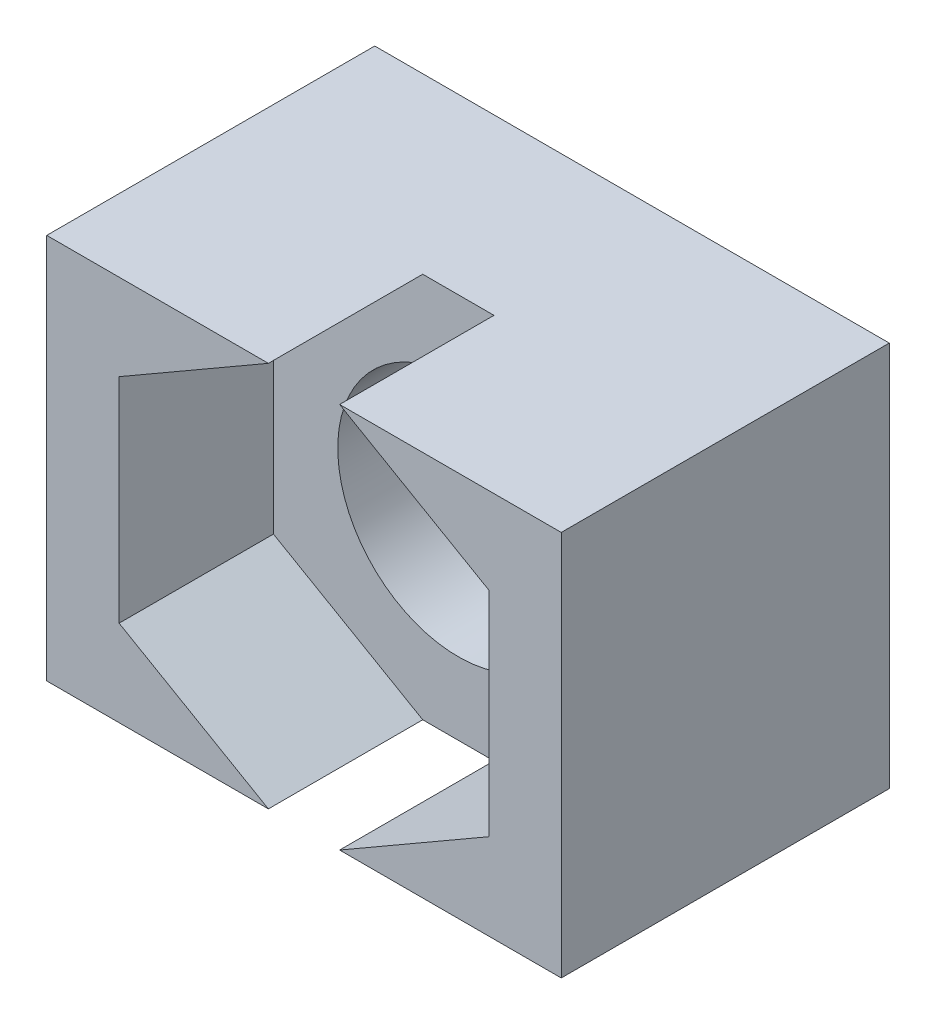
ISO-10303-21;
HEADER;
FILE_DESCRIPTION(('STEP AP214'),'2;1');
FILE_NAME('part.step','',(''),(''),'','','');
FILE_SCHEMA(('AUTOMOTIVE_DESIGN { 1 0 10303 214 1 1 1 1 }'));
ENDSEC;
DATA;
#1=APPLICATION_CONTEXT('core data for automotive mechanical design processes');
#2=APPLICATION_PROTOCOL_DEFINITION('international standard','automotive_design',2000,#1);
#3=PRODUCT_CONTEXT('',#1,'mechanical');
#4=PRODUCT('Part','Part','',(#3));
#5=PRODUCT_RELATED_PRODUCT_CATEGORY('part','',(#4));
#6=PRODUCT_DEFINITION_FORMATION('','',#4);
#7=PRODUCT_DEFINITION_CONTEXT('part definition',#1,'design');
#8=PRODUCT_DEFINITION('design','',#6,#7);
#9=PRODUCT_DEFINITION_SHAPE('','',#8);
#10=(LENGTH_UNIT() NAMED_UNIT(*) SI_UNIT(.MILLI.,.METRE.));
#11=(NAMED_UNIT(*) PLANE_ANGLE_UNIT() SI_UNIT($,.RADIAN.));
#12=(NAMED_UNIT(*) SI_UNIT($,.STERADIAN.) SOLID_ANGLE_UNIT());
#13=UNCERTAINTY_MEASURE_WITH_UNIT(LENGTH_MEASURE(1.E-05),#10,'distance_accuracy_value','');
#14=(GEOMETRIC_REPRESENTATION_CONTEXT(3) GLOBAL_UNCERTAINTY_ASSIGNED_CONTEXT((#13)) GLOBAL_UNIT_ASSIGNED_CONTEXT((#10,
#11,#12)) REPRESENTATION_CONTEXT('',''));
#15=CARTESIAN_POINT('',(0.,0.,0.));
#16=DIRECTION('',(0.,0.,1.));
#17=DIRECTION('',(1.,0.,0.));
#18=AXIS2_PLACEMENT_3D('',#15,#16,#17);
#19=CARTESIAN_POINT('',(0.,0.,5.1));
#20=DIRECTION('',(0.,0.,1.));
#21=DIRECTION('',(1.,0.,0.));
#22=AXIS2_PLACEMENT_3D('',#19,#20,#21);
#23=PLANE('',#22);
#24=DIRECTION('',(0.866025403784438,-0.5,0.));
#25=VECTOR('',#24,1.);
#26=CARTESIAN_POINT('',(-2.875,-1.65988202392017,5.1));
#27=LINE('',#26,#25);
#28=CARTESIAN_POINT('',(-2.875,-1.65988202392017,5.1));
#29=VERTEX_POINT('',#28);
#30=CARTESIAN_POINT('',(-0.553847577293371,-3.,5.1));
#31=VERTEX_POINT('',#30);
#32=EDGE_CURVE('E162',#29,#31,#27,.T.);
#33=ORIENTED_EDGE('',*,*,#32,.F.);
#34=DIRECTION('',(0.,-1.,0.));
#35=VECTOR('',#34,1.);
#36=CARTESIAN_POINT('',(-2.875,1.65988202392017,5.1));
#37=LINE('',#36,#35);
#38=CARTESIAN_POINT('',(-2.875,1.65988202392017,5.1));
#39=VERTEX_POINT('',#38);
#40=EDGE_CURVE('E169',#39,#29,#37,.T.);
#41=ORIENTED_EDGE('',*,*,#40,.F.);
#42=DIRECTION('',(-0.866025403784439,-0.5,0.));
#43=VECTOR('',#42,1.);
#44=CARTESIAN_POINT('',(-1.4375,2.48982303588026,5.1));
#45=LINE('',#44,#43);
#46=CARTESIAN_POINT('',(-0.553847577293371,3.,5.1));
#47=VERTEX_POINT('',#46);
#48=EDGE_CURVE('E40',#47,#39,#45,.T.);
#49=ORIENTED_EDGE('',*,*,#48,.F.);
#50=DIRECTION('',(-1.,0.,0.));
#51=VECTOR('',#50,1.);
#52=CARTESIAN_POINT('',(-4.,3.,5.1));
#53=LINE('',#52,#51);
#54=CARTESIAN_POINT('',(-4.,3.,5.1));
#55=VERTEX_POINT('',#54);
#56=EDGE_CURVE('E192',#47,#55,#53,.T.);
#57=ORIENTED_EDGE('',*,*,#56,.T.);
#58=DIRECTION('',(0.,-1.,0.));
#59=VECTOR('',#58,1.);
#60=CARTESIAN_POINT('',(-4.,3.,5.1));
#61=LINE('',#60,#59);
#62=CARTESIAN_POINT('',(-4.,-3.,5.1));
#63=VERTEX_POINT('',#62);
#64=EDGE_CURVE('E194',#55,#63,#61,.T.);
#65=ORIENTED_EDGE('',*,*,#64,.T.);
#66=DIRECTION('',(1.,0.,0.));
#67=VECTOR('',#66,1.);
#68=CARTESIAN_POINT('',(-4.,-3.,5.1));
#69=LINE('',#68,#67);
#70=EDGE_CURVE('E196',#63,#31,#69,.T.);
#71=ORIENTED_EDGE('',*,*,#70,.T.);
#72=EDGE_LOOP('',(#33,#41,#49,#57,#65,#71));
#73=FACE_BOUND('',#72,.T.);
#74=ADVANCED_FACE('F32',(#73),#23,.T.);
#75=CARTESIAN_POINT('',(4.,3.,5.1));
#76=DIRECTION('',(-1.,0.,0.));
#77=DIRECTION('',(0.,0.,1.));
#78=AXIS2_PLACEMENT_3D('',#75,#76,#77);
#79=PLANE('',#78);
#80=DIRECTION('',(0.,1.,0.));
#81=VECTOR('',#80,1.);
#82=CARTESIAN_POINT('',(4.,3.,0.));
#83=LINE('',#82,#81);
#84=CARTESIAN_POINT('',(4.,-3.,0.));
#85=VERTEX_POINT('',#84);
#86=CARTESIAN_POINT('',(4.,3.,0.));
#87=VERTEX_POINT('',#86);
#88=EDGE_CURVE('E189',#85,#87,#83,.T.);
#89=ORIENTED_EDGE('',*,*,#88,.T.);
#90=DIRECTION('',(0.,0.,-1.));
#91=VECTOR('',#90,1.);
#92=CARTESIAN_POINT('',(4.,3.,5.1));
#93=LINE('',#92,#91);
#94=CARTESIAN_POINT('',(4.,3.,5.1));
#95=VERTEX_POINT('',#94);
#96=EDGE_CURVE('E213',#95,#87,#93,.T.);
#97=ORIENTED_EDGE('',*,*,#96,.F.);
#98=DIRECTION('',(0.,1.,0.));
#99=VECTOR('',#98,1.);
#100=CARTESIAN_POINT('',(4.,3.,5.1));
#101=LINE('',#100,#99);
#102=CARTESIAN_POINT('',(4.,-3.,5.1));
#103=VERTEX_POINT('',#102);
#104=EDGE_CURVE('E190',#103,#95,#101,.T.);
#105=ORIENTED_EDGE('',*,*,#104,.F.);
#106=DIRECTION('',(0.,0.,-1.));
#107=VECTOR('',#106,1.);
#108=CARTESIAN_POINT('',(4.,-3.,5.1));
#109=LINE('',#108,#107);
#110=EDGE_CURVE('E199',#103,#85,#109,.T.);
#111=ORIENTED_EDGE('',*,*,#110,.T.);
#112=EDGE_LOOP('',(#89,#97,#105,#111));
#113=FACE_BOUND('',#112,.T.);
#114=ADVANCED_FACE('F34',(#113),#79,.F.);
#115=CARTESIAN_POINT('',(-4.,3.,5.1));
#116=DIRECTION('',(0.,-1.,0.));
#117=DIRECTION('',(0.,0.,-1.));
#118=AXIS2_PLACEMENT_3D('',#115,#116,#117);
#119=PLANE('',#118);
#120=ORIENTED_EDGE('',*,*,#56,.F.);
#121=DIRECTION('',(0.,0.,-1.));
#122=VECTOR('',#121,1.);
#123=CARTESIAN_POINT('',(-0.553847577293371,3.,5.1));
#124=LINE('',#123,#122);
#125=CARTESIAN_POINT('',(-0.55384757729337,3.,2.7));
#126=VERTEX_POINT('',#125);
#127=EDGE_CURVE('E181',#47,#126,#124,.T.);
#128=ORIENTED_EDGE('',*,*,#127,.T.);
#129=DIRECTION('',(-1.,0.,0.));
#130=VECTOR('',#129,1.);
#131=CARTESIAN_POINT('',(-4.,3.,2.7));
#132=LINE('',#131,#130);
#133=CARTESIAN_POINT('',(0.553847577293372,3.,2.7));
#134=VERTEX_POINT('',#133);
#135=EDGE_CURVE('E187',#134,#126,#132,.T.);
#136=ORIENTED_EDGE('',*,*,#135,.F.);
#137=DIRECTION('',(0.,0.,1.));
#138=VECTOR('',#137,1.);
#139=CARTESIAN_POINT('',(0.553847577293373,3.,5.1));
#140=LINE('',#139,#138);
#141=CARTESIAN_POINT('',(0.553847577293372,3.,5.1));
#142=VERTEX_POINT('',#141);
#143=EDGE_CURVE('E179',#134,#142,#140,.T.);
#144=ORIENTED_EDGE('',*,*,#143,.T.);
#145=EDGE_CURVE('E85',#95,#142,#53,.T.);
#146=ORIENTED_EDGE('',*,*,#145,.F.);
#147=ORIENTED_EDGE('',*,*,#96,.T.);
#148=DIRECTION('',(-1.,0.,0.));
#149=VECTOR('',#148,1.);
#150=CARTESIAN_POINT('',(-4.,3.,0.));
#151=LINE('',#150,#149);
#152=CARTESIAN_POINT('',(-4.,3.,0.));
#153=VERTEX_POINT('',#152);
#154=EDGE_CURVE('E202',#87,#153,#151,.T.);
#155=ORIENTED_EDGE('',*,*,#154,.T.);
#156=DIRECTION('',(0.,0.,-1.));
#157=VECTOR('',#156,1.);
#158=CARTESIAN_POINT('',(-4.,3.,5.1));
#159=LINE('',#158,#157);
#160=EDGE_CURVE('E210',#55,#153,#159,.T.);
#161=ORIENTED_EDGE('',*,*,#160,.F.);
#162=EDGE_LOOP('',(#120,#128,#136,#144,#146,#147,#155,#161));
#163=FACE_BOUND('',#162,.T.);
#164=ADVANCED_FACE('F241',(#163),#119,.F.);
#165=CARTESIAN_POINT('',(-4.,3.,5.1));
#166=DIRECTION('',(1.,0.,0.));
#167=DIRECTION('',(0.,1.,0.));
#168=AXIS2_PLACEMENT_3D('',#165,#166,#167);
#169=PLANE('',#168);
#170=DIRECTION('',(0.,-1.,0.));
#171=VECTOR('',#170,1.);
#172=CARTESIAN_POINT('',(-4.,3.,0.));
#173=LINE('',#172,#171);
#174=CARTESIAN_POINT('',(-4.,-3.,0.));
#175=VERTEX_POINT('',#174);
#176=EDGE_CURVE('E204',#153,#175,#173,.T.);
#177=ORIENTED_EDGE('',*,*,#176,.T.);
#178=DIRECTION('',(0.,0.,-1.));
#179=VECTOR('',#178,1.);
#180=CARTESIAN_POINT('',(-4.,-3.,5.1));
#181=LINE('',#180,#179);
#182=EDGE_CURVE('E208',#63,#175,#181,.T.);
#183=ORIENTED_EDGE('',*,*,#182,.F.);
#184=ORIENTED_EDGE('',*,*,#64,.F.);
#185=ORIENTED_EDGE('',*,*,#160,.T.);
#186=EDGE_LOOP('',(#177,#183,#184,#185));
#187=FACE_BOUND('',#186,.T.);
#188=ADVANCED_FACE('F272',(#187),#169,.F.);
#189=CARTESIAN_POINT('',(-4.,-3.,5.1));
#190=DIRECTION('',(0.,1.,0.));
#191=DIRECTION('',(0.,0.,1.));
#192=AXIS2_PLACEMENT_3D('',#189,#190,#191);
#193=PLANE('',#192);
#194=DIRECTION('',(1.,0.,0.));
#195=VECTOR('',#194,1.);
#196=CARTESIAN_POINT('',(-4.,-3.,2.7));
#197=LINE('',#196,#195);
#198=CARTESIAN_POINT('',(-0.553847577293371,-3.,2.7));
#199=VERTEX_POINT('',#198);
#200=CARTESIAN_POINT('',(0.553847577293368,-3.,2.7));
#201=VERTEX_POINT('',#200);
#202=EDGE_CURVE('E11',#199,#201,#197,.T.);
#203=ORIENTED_EDGE('',*,*,#202,.F.);
#204=DIRECTION('',(0.,0.,1.));
#205=VECTOR('',#204,1.);
#206=CARTESIAN_POINT('',(-0.553847577293371,-3.,5.1));
#207=LINE('',#206,#205);
#208=EDGE_CURVE('E184',#199,#31,#207,.T.);
#209=ORIENTED_EDGE('',*,*,#208,.T.);
#210=ORIENTED_EDGE('',*,*,#70,.F.);
#211=ORIENTED_EDGE('',*,*,#182,.T.);
#212=DIRECTION('',(1.,0.,0.));
#213=VECTOR('',#212,1.);
#214=CARTESIAN_POINT('',(-4.,-3.,0.));
#215=LINE('',#214,#213);
#216=EDGE_CURVE('E77',#175,#85,#215,.T.);
#217=ORIENTED_EDGE('',*,*,#216,.T.);
#218=ORIENTED_EDGE('',*,*,#110,.F.);
#219=CARTESIAN_POINT('',(0.55384757729336,-3.,5.1));
#220=VERTEX_POINT('',#219);
#221=EDGE_CURVE('E55',#220,#103,#69,.T.);
#222=ORIENTED_EDGE('',*,*,#221,.F.);
#223=DIRECTION('',(0.,0.,-1.));
#224=VECTOR('',#223,1.);
#225=CARTESIAN_POINT('',(0.553847577293367,-3.,5.1));
#226=LINE('',#225,#224);
#227=EDGE_CURVE('E47',#220,#201,#226,.T.);
#228=ORIENTED_EDGE('',*,*,#227,.T.);
#229=EDGE_LOOP('',(#203,#209,#210,#211,#217,#218,#222,#228));
#230=FACE_BOUND('',#229,.T.);
#231=ADVANCED_FACE('F231',(#230),#193,.F.);
#232=DIRECTION('',(-0.866025403784439,0.5,0.));
#233=VECTOR('',#232,1.);
#234=CARTESIAN_POINT('',(2.875,1.65988202392018,5.1));
#235=LINE('',#234,#233);
#236=CARTESIAN_POINT('',(2.875,1.65988202392018,5.1));
#237=VERTEX_POINT('',#236);
#238=EDGE_CURVE('E167',#237,#142,#235,.T.);
#239=ORIENTED_EDGE('',*,*,#238,.F.);
#240=DIRECTION('',(0.,1.,0.));
#241=VECTOR('',#240,1.);
#242=CARTESIAN_POINT('',(2.875,-1.65988202392017,5.1));
#243=LINE('',#242,#241);
#244=CARTESIAN_POINT('',(2.875,-1.65988202392017,5.1));
#245=VERTEX_POINT('',#244);
#246=EDGE_CURVE('E164',#245,#237,#243,.T.);
#247=ORIENTED_EDGE('',*,*,#246,.F.);
#248=DIRECTION('',(0.866025403784439,0.5,0.));
#249=VECTOR('',#248,1.);
#250=CARTESIAN_POINT('',(1.4375,-2.48982303588026,5.1));
#251=LINE('',#250,#249);
#252=EDGE_CURVE('E144',#220,#245,#251,.T.);
#253=ORIENTED_EDGE('',*,*,#252,.F.);
#254=ORIENTED_EDGE('',*,*,#221,.T.);
#255=ORIENTED_EDGE('',*,*,#104,.T.);
#256=ORIENTED_EDGE('',*,*,#145,.T.);
#257=EDGE_LOOP('',(#239,#247,#253,#254,#255,#256));
#258=FACE_BOUND('',#257,.T.);
#259=ADVANCED_FACE('F237',(#258),#23,.T.);
#260=CARTESIAN_POINT('',(0.,0.,0.));
#261=DIRECTION('',(0.,0.,1.));
#262=DIRECTION('',(1.,0.,0.));
#263=AXIS2_PLACEMENT_3D('',#260,#261,#262);
#264=PLANE('',#263);
#265=CARTESIAN_POINT('',(0.,0.,0.));
#266=DIRECTION('',(0.,0.,1.));
#267=DIRECTION('',(1.,0.,0.));
#268=AXIS2_PLACEMENT_3D('',#265,#266,#267);
#269=CIRCLE('',#268,1.875);
#270=CARTESIAN_POINT('',(1.875,0.,0.));
#271=VERTEX_POINT('',#270);
#272=EDGE_CURVE('E165',#271,#271,#269,.F.);
#273=ORIENTED_EDGE('',*,*,#272,.F.);
#274=EDGE_LOOP('',(#273));
#275=FACE_BOUND('',#274,.T.);
#276=ORIENTED_EDGE('',*,*,#88,.F.);
#277=ORIENTED_EDGE('',*,*,#216,.F.);
#278=ORIENTED_EDGE('',*,*,#176,.F.);
#279=ORIENTED_EDGE('',*,*,#154,.F.);
#280=EDGE_LOOP('',(#276,#277,#278,#279));
#281=FACE_BOUND('',#280,.T.);
#282=ADVANCED_FACE('F252',(#275,#281),#264,.F.);
#283=CARTESIAN_POINT('',(0.,0.,2.7));
#284=DIRECTION('',(0.,0.,1.));
#285=DIRECTION('',(1.,0.,0.));
#286=AXIS2_PLACEMENT_3D('',#283,#284,#285);
#287=PLANE('',#286);
#288=CARTESIAN_POINT('',(0.,0.,2.7));
#289=DIRECTION('',(0.,0.,1.));
#290=DIRECTION('',(1.,0.,0.));
#291=AXIS2_PLACEMENT_3D('',#288,#289,#290);
#292=CIRCLE('',#291,1.875);
#293=CARTESIAN_POINT('',(1.875,0.,2.7));
#294=VERTEX_POINT('',#293);
#295=EDGE_CURVE('E245',#294,#294,#292,.T.);
#296=ORIENTED_EDGE('',*,*,#295,.F.);
#297=EDGE_LOOP('',(#296));
#298=FACE_BOUND('',#297,.T.);
#299=ORIENTED_EDGE('',*,*,#135,.T.);
#300=DIRECTION('',(-0.866025403784438,-0.5,0.));
#301=VECTOR('',#300,1.);
#302=CARTESIAN_POINT('',(0.,3.31976404784035,2.7));
#303=LINE('',#302,#301);
#304=CARTESIAN_POINT('',(-2.875,1.65988202392017,2.7));
#305=VERTEX_POINT('',#304);
#306=EDGE_CURVE('E155',#126,#305,#303,.T.);
#307=ORIENTED_EDGE('',*,*,#306,.T.);
#308=DIRECTION('',(0.,-1.,0.));
#309=VECTOR('',#308,1.);
#310=CARTESIAN_POINT('',(-2.875,1.65988202392017,2.7));
#311=LINE('',#310,#309);
#312=CARTESIAN_POINT('',(-2.875,-1.65988202392017,2.7));
#313=VERTEX_POINT('',#312);
#314=EDGE_CURVE('E149',#305,#313,#311,.T.);
#315=ORIENTED_EDGE('',*,*,#314,.T.);
#316=DIRECTION('',(0.866025403784438,-0.5,0.));
#317=VECTOR('',#316,1.);
#318=CARTESIAN_POINT('',(-2.875,-1.65988202392017,2.7));
#319=LINE('',#318,#317);
#320=EDGE_CURVE('E139',#313,#199,#319,.T.);
#321=ORIENTED_EDGE('',*,*,#320,.T.);
#322=ORIENTED_EDGE('',*,*,#202,.T.);
#323=DIRECTION('',(0.866025403784439,0.5,0.));
#324=VECTOR('',#323,1.);
#325=CARTESIAN_POINT('',(0.,-3.31976404784035,2.7));
#326=LINE('',#325,#324);
#327=CARTESIAN_POINT('',(2.875,-1.65988202392017,2.7));
#328=VERTEX_POINT('',#327);
#329=EDGE_CURVE('E131',#201,#328,#326,.T.);
#330=ORIENTED_EDGE('',*,*,#329,.T.);
#331=DIRECTION('',(0.,1.,0.));
#332=VECTOR('',#331,1.);
#333=CARTESIAN_POINT('',(2.875,-1.65988202392017,2.7));
#334=LINE('',#333,#332);
#335=CARTESIAN_POINT('',(2.875,1.65988202392018,2.7));
#336=VERTEX_POINT('',#335);
#337=EDGE_CURVE('E136',#328,#336,#334,.T.);
#338=ORIENTED_EDGE('',*,*,#337,.T.);
#339=DIRECTION('',(-0.866025403784439,0.5,0.));
#340=VECTOR('',#339,1.);
#341=CARTESIAN_POINT('',(2.875,1.65988202392018,2.7));
#342=LINE('',#341,#340);
#343=EDGE_CURVE('E153',#336,#134,#342,.T.);
#344=ORIENTED_EDGE('',*,*,#343,.T.);
#345=EDGE_LOOP('',(#299,#307,#315,#321,#322,#330,#338,#344));
#346=FACE_BOUND('',#345,.T.);
#347=ADVANCED_FACE('F133',(#298,#346),#287,.T.);
#348=CARTESIAN_POINT('',(-2.875,-1.65988202392017,2.7));
#349=DIRECTION('',(-0.5,-0.866025403784439,0.));
#350=DIRECTION('',(0.866025403784439,-0.5,0.));
#351=AXIS2_PLACEMENT_3D('',#348,#349,#350);
#352=PLANE('',#351);
#353=ORIENTED_EDGE('',*,*,#320,.F.);
#354=DIRECTION('',(0.,0.,1.));
#355=VECTOR('',#354,1.);
#356=CARTESIAN_POINT('',(-2.875,-1.65988202392017,2.7));
#357=LINE('',#356,#355);
#358=EDGE_CURVE('E172',#313,#29,#357,.T.);
#359=ORIENTED_EDGE('',*,*,#358,.T.);
#360=ORIENTED_EDGE('',*,*,#32,.T.);
#361=ORIENTED_EDGE('',*,*,#208,.F.);
#362=EDGE_LOOP('',(#353,#359,#360,#361));
#363=FACE_BOUND('',#362,.T.);
#364=ADVANCED_FACE('F230',(#363),#352,.F.);
#365=CARTESIAN_POINT('',(0.,3.31976404784035,2.7));
#366=DIRECTION('',(-0.5,0.866025403784439,0.));
#367=DIRECTION('',(-0.866025403784439,-0.5,0.));
#368=AXIS2_PLACEMENT_3D('',#365,#366,#367);
#369=PLANE('',#368);
#370=ORIENTED_EDGE('',*,*,#48,.T.);
#371=DIRECTION('',(0.,0.,1.));
#372=VECTOR('',#371,1.);
#373=CARTESIAN_POINT('',(-2.875,1.65988202392017,2.7));
#374=LINE('',#373,#372);
#375=EDGE_CURVE('E174',#305,#39,#374,.T.);
#376=ORIENTED_EDGE('',*,*,#375,.F.);
#377=ORIENTED_EDGE('',*,*,#306,.F.);
#378=ORIENTED_EDGE('',*,*,#127,.F.);
#379=EDGE_LOOP('',(#370,#376,#377,#378));
#380=FACE_BOUND('',#379,.T.);
#381=ADVANCED_FACE('F218',(#380),#369,.F.);
#382=CARTESIAN_POINT('',(2.875,1.65988202392018,2.7));
#383=DIRECTION('',(0.5,0.866025403784439,0.));
#384=DIRECTION('',(-0.866025403784439,0.5,0.));
#385=AXIS2_PLACEMENT_3D('',#382,#383,#384);
#386=PLANE('',#385);
#387=ORIENTED_EDGE('',*,*,#343,.F.);
#388=DIRECTION('',(0.,0.,1.));
#389=VECTOR('',#388,1.);
#390=CARTESIAN_POINT('',(2.875,1.65988202392018,2.7));
#391=LINE('',#390,#389);
#392=EDGE_CURVE('E148',#336,#237,#391,.T.);
#393=ORIENTED_EDGE('',*,*,#392,.T.);
#394=ORIENTED_EDGE('',*,*,#238,.T.);
#395=ORIENTED_EDGE('',*,*,#143,.F.);
#396=EDGE_LOOP('',(#387,#393,#394,#395));
#397=FACE_BOUND('',#396,.T.);
#398=ADVANCED_FACE('F239',(#397),#386,.F.);
#399=CARTESIAN_POINT('',(0.,-3.31976404784035,2.7));
#400=DIRECTION('',(0.5,-0.866025403784439,0.));
#401=DIRECTION('',(0.866025403784439,0.5,0.));
#402=AXIS2_PLACEMENT_3D('',#399,#400,#401);
#403=PLANE('',#402);
#404=ORIENTED_EDGE('',*,*,#252,.T.);
#405=DIRECTION('',(0.,0.,1.));
#406=VECTOR('',#405,1.);
#407=CARTESIAN_POINT('',(2.875,-1.65988202392017,2.7));
#408=LINE('',#407,#406);
#409=EDGE_CURVE('E142',#328,#245,#408,.T.);
#410=ORIENTED_EDGE('',*,*,#409,.F.);
#411=ORIENTED_EDGE('',*,*,#329,.F.);
#412=ORIENTED_EDGE('',*,*,#227,.F.);
#413=EDGE_LOOP('',(#404,#410,#411,#412));
#414=FACE_BOUND('',#413,.T.);
#415=ADVANCED_FACE('F143',(#414),#403,.F.);
#416=CARTESIAN_POINT('',(-2.875,1.65988202392017,2.7));
#417=DIRECTION('',(-1.,0.,0.));
#418=DIRECTION('',(0.,-1.,0.));
#419=AXIS2_PLACEMENT_3D('',#416,#417,#418);
#420=PLANE('',#419);
#421=ORIENTED_EDGE('',*,*,#40,.T.);
#422=ORIENTED_EDGE('',*,*,#358,.F.);
#423=ORIENTED_EDGE('',*,*,#314,.F.);
#424=ORIENTED_EDGE('',*,*,#375,.T.);
#425=EDGE_LOOP('',(#421,#422,#423,#424));
#426=FACE_BOUND('',#425,.T.);
#427=ADVANCED_FACE('F225',(#426),#420,.F.);
#428=CARTESIAN_POINT('',(2.875,-1.65988202392017,2.7));
#429=DIRECTION('',(1.,0.,0.));
#430=DIRECTION('',(0.,0.,-1.));
#431=AXIS2_PLACEMENT_3D('',#428,#429,#430);
#432=PLANE('',#431);
#433=ORIENTED_EDGE('',*,*,#246,.T.);
#434=ORIENTED_EDGE('',*,*,#392,.F.);
#435=ORIENTED_EDGE('',*,*,#337,.F.);
#436=ORIENTED_EDGE('',*,*,#409,.T.);
#437=EDGE_LOOP('',(#433,#434,#435,#436));
#438=FACE_BOUND('',#437,.T.);
#439=ADVANCED_FACE('F151',(#438),#432,.F.);
#440=CARTESIAN_POINT('',(0.,0.,-5.30330085889911));
#441=DIRECTION('',(0.,0.,1.));
#442=DIRECTION('',(1.,0.,0.));
#443=AXIS2_PLACEMENT_3D('',#440,#441,#442);
#444=CYLINDRICAL_SURFACE('',#443,1.875);
#445=ORIENTED_EDGE('',*,*,#272,.T.);
#446=EDGE_LOOP('',(#445));
#447=FACE_BOUND('',#446,.T.);
#448=ORIENTED_EDGE('',*,*,#295,.T.);
#449=EDGE_LOOP('',(#448));
#450=FACE_BOUND('',#449,.T.);
#451=ADVANCED_FACE('F249',(#447,#450),#444,.F.);
#452=CLOSED_SHELL('',(#74,#114,#164,#188,#231,#259,#282,#347,#364,#381,#398,#415,#427,#439,#451));
#453=MANIFOLD_SOLID_BREP('B2',#452);
#454=ADVANCED_BREP_SHAPE_REPRESENTATION('',(#18,#453),#14);
#455=SHAPE_DEFINITION_REPRESENTATION(#9,#454);
ENDSEC;
END-ISO-10303-21;
